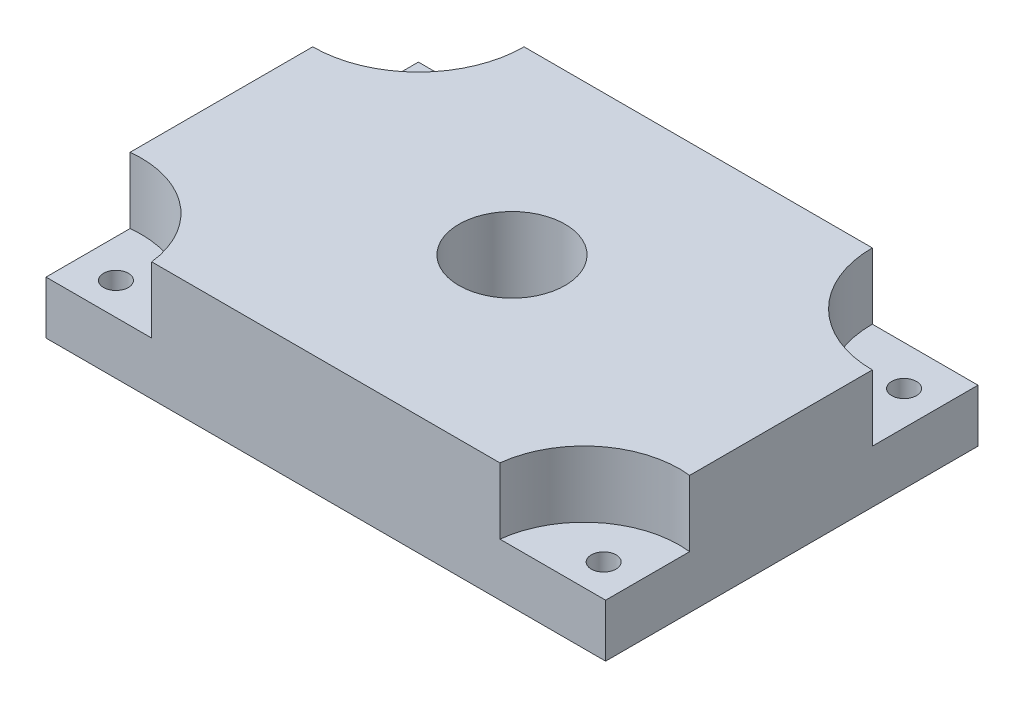
ISO-10303-21;
HEADER;
FILE_DESCRIPTION(('STEP AP214'),'2;1');
FILE_NAME('part.step','',(''),(''),'','','');
FILE_SCHEMA(('AUTOMOTIVE_DESIGN { 1 0 10303 214 1 1 1 1 }'));
ENDSEC;
DATA;
#1=APPLICATION_CONTEXT('core data for automotive mechanical design processes');
#2=APPLICATION_PROTOCOL_DEFINITION('international standard','automotive_design',2000,#1);
#3=PRODUCT_CONTEXT('',#1,'mechanical');
#4=PRODUCT('Part','Part','',(#3));
#5=PRODUCT_RELATED_PRODUCT_CATEGORY('part','',(#4));
#6=PRODUCT_DEFINITION_FORMATION('','',#4);
#7=PRODUCT_DEFINITION_CONTEXT('part definition',#1,'design');
#8=PRODUCT_DEFINITION('design','',#6,#7);
#9=PRODUCT_DEFINITION_SHAPE('','',#8);
#10=(LENGTH_UNIT() NAMED_UNIT(*) SI_UNIT(.MILLI.,.METRE.));
#11=(NAMED_UNIT(*) PLANE_ANGLE_UNIT() SI_UNIT($,.RADIAN.));
#12=(NAMED_UNIT(*) SI_UNIT($,.STERADIAN.) SOLID_ANGLE_UNIT());
#13=UNCERTAINTY_MEASURE_WITH_UNIT(LENGTH_MEASURE(1.E-05),#10,'distance_accuracy_value','');
#14=(GEOMETRIC_REPRESENTATION_CONTEXT(3) GLOBAL_UNCERTAINTY_ASSIGNED_CONTEXT((#13)) GLOBAL_UNIT_ASSIGNED_CONTEXT((#10,
#11,#12)) REPRESENTATION_CONTEXT('',''));
#15=CARTESIAN_POINT('',(0.,0.,0.));
#16=DIRECTION('',(0.,0.,1.));
#17=DIRECTION('',(1.,0.,0.));
#18=AXIS2_PLACEMENT_3D('',#15,#16,#17);
#19=CARTESIAN_POINT('',(0.,2.54,0.));
#20=DIRECTION('',(0.,1.,0.));
#21=DIRECTION('',(0.,0.,1.));
#22=AXIS2_PLACEMENT_3D('',#19,#20,#21);
#23=PLANE('',#22);
#24=CARTESIAN_POINT('',(-11.6306743768178,2.54,7.40687426286435));
#25=DIRECTION('',(0.,1.,0.));
#26=DIRECTION('',(0.,0.,1.));
#27=AXIS2_PLACEMENT_3D('',#24,#25,#26);
#28=CIRCLE('',#27,0.595376);
#29=CARTESIAN_POINT('',(-11.6306743768178,2.54,8.00225026286435));
#30=VERTEX_POINT('',#29);
#31=EDGE_CURVE('E266',#30,#30,#28,.T.);
#32=ORIENTED_EDGE('',*,*,#31,.F.);
#33=EDGE_LOOP('',(#32));
#34=FACE_BOUND('',#33,.T.);
#35=CARTESIAN_POINT('',(-12.9296799296813,2.54,9.4703200703187));
#36=DIRECTION('',(0.,-1.,0.));
#37=DIRECTION('',(0.,0.,-1.));
#38=AXIS2_PLACEMENT_3D('',#35,#36,#37);
#39=CIRCLE('',#38,4.58927162376722);
#40=CARTESIAN_POINT('',(-13.45,2.54,4.91064014063738));
#41=VERTEX_POINT('',#40);
#42=CARTESIAN_POINT('',(-8.37000000000002,2.54,8.95));
#43=VERTEX_POINT('',#42);
#44=EDGE_CURVE('E146',#41,#43,#39,.T.);
#45=ORIENTED_EDGE('',*,*,#44,.F.);
#46=DIRECTION('',(0.,0.,1.));
#47=VECTOR('',#46,1.);
#48=CARTESIAN_POINT('',(-13.45,2.54,-8.95));
#49=LINE('',#48,#47);
#50=CARTESIAN_POINT('',(-13.45,2.54,8.95));
#51=VERTEX_POINT('',#50);
#52=EDGE_CURVE('E162',#41,#51,#49,.T.);
#53=ORIENTED_EDGE('',*,*,#52,.T.);
#54=DIRECTION('',(1.,0.,0.));
#55=VECTOR('',#54,1.);
#56=CARTESIAN_POINT('',(-13.45,2.54,8.95));
#57=LINE('',#56,#55);
#58=EDGE_CURVE('E58',#51,#43,#57,.T.);
#59=ORIENTED_EDGE('',*,*,#58,.T.);
#60=EDGE_LOOP('',(#45,#53,#59));
#61=FACE_BOUND('',#60,.T.);
#62=ADVANCED_FACE('F35',(#34,#61),#23,.T.);
#63=CARTESIAN_POINT('',(-11.6306743768178,2.54,-7.03306943770432));
#64=DIRECTION('',(0.,1.,0.));
#65=DIRECTION('',(0.,0.,1.));
#66=AXIS2_PLACEMENT_3D('',#63,#64,#65);
#67=CIRCLE('',#66,0.595376);
#68=CARTESIAN_POINT('',(-11.6306743768178,2.54,-6.43769343770432));
#69=VERTEX_POINT('',#68);
#70=EDGE_CURVE('E272',#69,#69,#67,.T.);
#71=ORIENTED_EDGE('',*,*,#70,.F.);
#72=EDGE_LOOP('',(#71));
#73=FACE_BOUND('',#72,.T.);
#74=CARTESIAN_POINT('',(-13.45,2.54,-8.94999999999999));
#75=DIRECTION('',(0.,-1.,0.));
#76=DIRECTION('',(0.,0.,1.));
#77=AXIS2_PLACEMENT_3D('',#74,#75,#76);
#78=CIRCLE('',#77,5.07999999999999);
#79=CARTESIAN_POINT('',(-8.37000000000002,2.54,-8.95));
#80=VERTEX_POINT('',#79);
#81=CARTESIAN_POINT('',(-13.45,2.54,-3.87));
#82=VERTEX_POINT('',#81);
#83=EDGE_CURVE('E143',#80,#82,#78,.T.);
#84=ORIENTED_EDGE('',*,*,#83,.F.);
#85=DIRECTION('',(-1.,0.,0.));
#86=VECTOR('',#85,1.);
#87=CARTESIAN_POINT('',(-13.45,2.54,-8.95));
#88=LINE('',#87,#86);
#89=CARTESIAN_POINT('',(-13.45,2.54,-8.95));
#90=VERTEX_POINT('',#89);
#91=EDGE_CURVE('E158',#80,#90,#88,.T.);
#92=ORIENTED_EDGE('',*,*,#91,.T.);
#93=EDGE_CURVE('E163',#90,#82,#49,.T.);
#94=ORIENTED_EDGE('',*,*,#93,.T.);
#95=EDGE_LOOP('',(#84,#92,#94));
#96=FACE_BOUND('',#95,.T.);
#97=ADVANCED_FACE('F278',(#73,#96),#23,.T.);
#98=CARTESIAN_POINT('',(11.8134024359264,2.54,-7.03306943770432));
#99=DIRECTION('',(0.,1.,0.));
#100=DIRECTION('',(0.,0.,1.));
#101=AXIS2_PLACEMENT_3D('',#98,#99,#100);
#102=CIRCLE('',#101,0.595376);
#103=CARTESIAN_POINT('',(11.8134024359264,2.54,-6.43769343770432));
#104=VERTEX_POINT('',#103);
#105=EDGE_CURVE('E254',#104,#104,#102,.T.);
#106=ORIENTED_EDGE('',*,*,#105,.F.);
#107=EDGE_LOOP('',(#106));
#108=FACE_BOUND('',#107,.T.);
#109=CARTESIAN_POINT('',(13.45,2.54,-8.95));
#110=DIRECTION('',(0.,-1.,0.));
#111=DIRECTION('',(0.,0.,1.));
#112=AXIS2_PLACEMENT_3D('',#109,#110,#111);
#113=CIRCLE('',#112,5.08000000000001);
#114=CARTESIAN_POINT('',(13.45,2.54,-3.87));
#115=VERTEX_POINT('',#114);
#116=CARTESIAN_POINT('',(8.37000000000002,2.54,-8.95));
#117=VERTEX_POINT('',#116);
#118=EDGE_CURVE('E201',#115,#117,#113,.T.);
#119=ORIENTED_EDGE('',*,*,#118,.F.);
#120=DIRECTION('',(0.,0.,-1.));
#121=VECTOR('',#120,1.);
#122=CARTESIAN_POINT('',(13.45,2.54,-8.95));
#123=LINE('',#122,#121);
#124=CARTESIAN_POINT('',(13.45,2.54,-8.95));
#125=VERTEX_POINT('',#124);
#126=EDGE_CURVE('E159',#115,#125,#123,.T.);
#127=ORIENTED_EDGE('',*,*,#126,.T.);
#128=EDGE_CURVE('E160',#125,#117,#88,.T.);
#129=ORIENTED_EDGE('',*,*,#128,.T.);
#130=EDGE_LOOP('',(#119,#127,#129));
#131=FACE_BOUND('',#130,.T.);
#132=ADVANCED_FACE('F233',(#108,#131),#23,.T.);
#133=CARTESIAN_POINT('',(11.8134024359264,2.54,7.40687426286435));
#134=DIRECTION('',(0.,1.,0.));
#135=DIRECTION('',(0.,0.,1.));
#136=AXIS2_PLACEMENT_3D('',#133,#134,#135);
#137=CIRCLE('',#136,0.595376);
#138=CARTESIAN_POINT('',(11.8134024359264,2.54,8.00225026286435));
#139=VERTEX_POINT('',#138);
#140=EDGE_CURVE('E260',#139,#139,#137,.T.);
#141=ORIENTED_EDGE('',*,*,#140,.F.);
#142=EDGE_LOOP('',(#141));
#143=FACE_BOUND('',#142,.T.);
#144=CARTESIAN_POINT('',(12.9296799296814,2.54,9.47032007031873));
#145=DIRECTION('',(0.,-1.,0.));
#146=DIRECTION('',(0.,0.,1.));
#147=AXIS2_PLACEMENT_3D('',#144,#145,#146);
#148=CIRCLE('',#147,4.58927162376725);
#149=CARTESIAN_POINT('',(8.37000000000002,2.54,8.95));
#150=VERTEX_POINT('',#149);
#151=CARTESIAN_POINT('',(13.45,2.54,4.91064014063739));
#152=VERTEX_POINT('',#151);
#153=EDGE_CURVE('E50',#150,#152,#148,.T.);
#154=ORIENTED_EDGE('',*,*,#153,.F.);
#155=CARTESIAN_POINT('',(13.45,2.54,8.95));
#156=VERTEX_POINT('',#155);
#157=EDGE_CURVE('E165',#150,#156,#57,.T.);
#158=ORIENTED_EDGE('',*,*,#157,.T.);
#159=EDGE_CURVE('E156',#156,#152,#123,.T.);
#160=ORIENTED_EDGE('',*,*,#159,.T.);
#161=EDGE_LOOP('',(#154,#158,#160));
#162=FACE_BOUND('',#161,.T.);
#163=ADVANCED_FACE('F198',(#143,#162),#23,.T.);
#164=CARTESIAN_POINT('',(13.45,2.54,-8.95));
#165=DIRECTION('',(-1.,0.,0.));
#166=DIRECTION('',(0.,0.,1.));
#167=AXIS2_PLACEMENT_3D('',#164,#165,#166);
#168=PLANE('',#167);
#169=DIRECTION('',(0.,0.,-1.));
#170=VECTOR('',#169,1.);
#171=CARTESIAN_POINT('',(13.45,0.,-8.95));
#172=LINE('',#171,#170);
#173=CARTESIAN_POINT('',(13.45,0.,8.95));
#174=VERTEX_POINT('',#173);
#175=CARTESIAN_POINT('',(13.45,0.,-8.95));
#176=VERTEX_POINT('',#175);
#177=EDGE_CURVE('E147',#174,#176,#172,.T.);
#178=ORIENTED_EDGE('',*,*,#177,.T.);
#179=DIRECTION('',(0.,-1.,0.));
#180=VECTOR('',#179,1.);
#181=CARTESIAN_POINT('',(13.45,2.54,-8.95));
#182=LINE('',#181,#180);
#183=EDGE_CURVE('E11',#125,#176,#182,.T.);
#184=ORIENTED_EDGE('',*,*,#183,.F.);
#185=ORIENTED_EDGE('',*,*,#126,.F.);
#186=DIRECTION('',(0.,-1.,0.));
#187=VECTOR('',#186,1.);
#188=CARTESIAN_POINT('',(13.45,5.715,-3.87));
#189=LINE('',#188,#187);
#190=CARTESIAN_POINT('',(13.45,5.715,-3.87));
#191=VERTEX_POINT('',#190);
#192=EDGE_CURVE('E221',#191,#115,#189,.T.);
#193=ORIENTED_EDGE('',*,*,#192,.F.);
#194=DIRECTION('',(0.,0.,-1.));
#195=VECTOR('',#194,1.);
#196=CARTESIAN_POINT('',(13.45,5.715,-3.87));
#197=LINE('',#196,#195);
#198=CARTESIAN_POINT('',(13.45,5.715,4.91064014063739));
#199=VERTEX_POINT('',#198);
#200=EDGE_CURVE('E230',#199,#191,#197,.T.);
#201=ORIENTED_EDGE('',*,*,#200,.F.);
#202=DIRECTION('',(0.,-1.,0.));
#203=VECTOR('',#202,1.);
#204=CARTESIAN_POINT('',(13.45,5.715,4.91064014063739));
#205=LINE('',#204,#203);
#206=EDGE_CURVE('E152',#199,#152,#205,.T.);
#207=ORIENTED_EDGE('',*,*,#206,.T.);
#208=ORIENTED_EDGE('',*,*,#159,.F.);
#209=DIRECTION('',(0.,-1.,0.));
#210=VECTOR('',#209,1.);
#211=CARTESIAN_POINT('',(13.45,2.54,8.95));
#212=LINE('',#211,#210);
#213=EDGE_CURVE('E166',#156,#174,#212,.T.);
#214=ORIENTED_EDGE('',*,*,#213,.T.);
#215=EDGE_LOOP('',(#178,#184,#185,#193,#201,#207,#208,#214));
#216=FACE_BOUND('',#215,.T.);
#217=ADVANCED_FACE('F37',(#216),#168,.F.);
#218=CARTESIAN_POINT('',(-13.45,2.54,-8.95));
#219=DIRECTION('',(0.,0.,1.));
#220=DIRECTION('',(1.,0.,0.));
#221=AXIS2_PLACEMENT_3D('',#218,#219,#220);
#222=PLANE('',#221);
#223=DIRECTION('',(-1.,0.,0.));
#224=VECTOR('',#223,1.);
#225=CARTESIAN_POINT('',(-13.45,0.,-8.95));
#226=LINE('',#225,#224);
#227=CARTESIAN_POINT('',(-13.45,0.,-8.95));
#228=VERTEX_POINT('',#227);
#229=EDGE_CURVE('E150',#176,#228,#226,.T.);
#230=ORIENTED_EDGE('',*,*,#229,.T.);
#231=DIRECTION('',(0.,-1.,0.));
#232=VECTOR('',#231,1.);
#233=CARTESIAN_POINT('',(-13.45,2.54,-8.95));
#234=LINE('',#233,#232);
#235=EDGE_CURVE('E43',#90,#228,#234,.T.);
#236=ORIENTED_EDGE('',*,*,#235,.F.);
#237=ORIENTED_EDGE('',*,*,#91,.F.);
#238=DIRECTION('',(0.,-1.,0.));
#239=VECTOR('',#238,1.);
#240=CARTESIAN_POINT('',(-8.37000000000002,5.715,-8.95));
#241=LINE('',#240,#239);
#242=CARTESIAN_POINT('',(-8.37000000000002,5.715,-8.95));
#243=VERTEX_POINT('',#242);
#244=EDGE_CURVE('E215',#243,#80,#241,.T.);
#245=ORIENTED_EDGE('',*,*,#244,.F.);
#246=DIRECTION('',(-1.,0.,0.));
#247=VECTOR('',#246,1.);
#248=CARTESIAN_POINT('',(-8.37000000000002,5.715,-8.95));
#249=LINE('',#248,#247);
#250=CARTESIAN_POINT('',(8.37000000000002,5.715,-8.95));
#251=VERTEX_POINT('',#250);
#252=EDGE_CURVE('E237',#251,#243,#249,.T.);
#253=ORIENTED_EDGE('',*,*,#252,.F.);
#254=DIRECTION('',(0.,-1.,0.));
#255=VECTOR('',#254,1.);
#256=CARTESIAN_POINT('',(8.37000000000002,5.715,-8.95));
#257=LINE('',#256,#255);
#258=EDGE_CURVE('E218',#251,#117,#257,.T.);
#259=ORIENTED_EDGE('',*,*,#258,.T.);
#260=ORIENTED_EDGE('',*,*,#128,.F.);
#261=ORIENTED_EDGE('',*,*,#183,.T.);
#262=EDGE_LOOP('',(#230,#236,#237,#245,#253,#259,#260,#261));
#263=FACE_BOUND('',#262,.T.);
#264=ADVANCED_FACE('F234',(#263),#222,.F.);
#265=CARTESIAN_POINT('',(-13.45,2.54,-8.95));
#266=DIRECTION('',(1.,0.,0.));
#267=DIRECTION('',(0.,0.,-1.));
#268=AXIS2_PLACEMENT_3D('',#265,#266,#267);
#269=PLANE('',#268);
#270=DIRECTION('',(0.,0.,1.));
#271=VECTOR('',#270,1.);
#272=CARTESIAN_POINT('',(-13.45,0.,-8.95));
#273=LINE('',#272,#271);
#274=CARTESIAN_POINT('',(-13.45,0.,8.95));
#275=VERTEX_POINT('',#274);
#276=EDGE_CURVE('E169',#228,#275,#273,.T.);
#277=ORIENTED_EDGE('',*,*,#276,.T.);
#278=DIRECTION('',(0.,-1.,0.));
#279=VECTOR('',#278,1.);
#280=CARTESIAN_POINT('',(-13.45,2.54,8.95));
#281=LINE('',#280,#279);
#282=EDGE_CURVE('E175',#51,#275,#281,.T.);
#283=ORIENTED_EDGE('',*,*,#282,.F.);
#284=ORIENTED_EDGE('',*,*,#52,.F.);
#285=DIRECTION('',(0.,-1.,0.));
#286=VECTOR('',#285,1.);
#287=CARTESIAN_POINT('',(-13.45,5.715,4.91064014063738));
#288=LINE('',#287,#286);
#289=CARTESIAN_POINT('',(-13.45,5.715,4.91064014063738));
#290=VERTEX_POINT('',#289);
#291=EDGE_CURVE('E211',#290,#41,#288,.T.);
#292=ORIENTED_EDGE('',*,*,#291,.F.);
#293=DIRECTION('',(0.,0.,1.));
#294=VECTOR('',#293,1.);
#295=CARTESIAN_POINT('',(-13.45,5.715,-3.87));
#296=LINE('',#295,#294);
#297=CARTESIAN_POINT('',(-13.45,5.715,-3.87));
#298=VERTEX_POINT('',#297);
#299=EDGE_CURVE('E139',#298,#290,#296,.T.);
#300=ORIENTED_EDGE('',*,*,#299,.F.);
#301=DIRECTION('',(0.,-1.,0.));
#302=VECTOR('',#301,1.);
#303=CARTESIAN_POINT('',(-13.45,5.715,-3.87));
#304=LINE('',#303,#302);
#305=EDGE_CURVE('E213',#298,#82,#304,.T.);
#306=ORIENTED_EDGE('',*,*,#305,.T.);
#307=ORIENTED_EDGE('',*,*,#93,.F.);
#308=ORIENTED_EDGE('',*,*,#235,.T.);
#309=EDGE_LOOP('',(#277,#283,#284,#292,#300,#306,#307,#308));
#310=FACE_BOUND('',#309,.T.);
#311=ADVANCED_FACE('F182',(#310),#269,.F.);
#312=CARTESIAN_POINT('',(-13.45,2.54,8.95));
#313=DIRECTION('',(0.,0.,-1.));
#314=DIRECTION('',(-1.,0.,0.));
#315=AXIS2_PLACEMENT_3D('',#312,#313,#314);
#316=PLANE('',#315);
#317=DIRECTION('',(1.,0.,0.));
#318=VECTOR('',#317,1.);
#319=CARTESIAN_POINT('',(-13.45,0.,8.95));
#320=LINE('',#319,#318);
#321=EDGE_CURVE('E171',#275,#174,#320,.T.);
#322=ORIENTED_EDGE('',*,*,#321,.T.);
#323=ORIENTED_EDGE('',*,*,#213,.F.);
#324=ORIENTED_EDGE('',*,*,#157,.F.);
#325=DIRECTION('',(0.,-1.,0.));
#326=VECTOR('',#325,1.);
#327=CARTESIAN_POINT('',(8.37000000000002,5.715,8.95));
#328=LINE('',#327,#326);
#329=CARTESIAN_POINT('',(8.37000000000002,5.715,8.95));
#330=VERTEX_POINT('',#329);
#331=EDGE_CURVE('E130',#330,#150,#328,.T.);
#332=ORIENTED_EDGE('',*,*,#331,.F.);
#333=DIRECTION('',(1.,0.,0.));
#334=VECTOR('',#333,1.);
#335=CARTESIAN_POINT('',(-8.37000000000002,5.715,8.95));
#336=LINE('',#335,#334);
#337=CARTESIAN_POINT('',(-8.37000000000002,5.715,8.95));
#338=VERTEX_POINT('',#337);
#339=EDGE_CURVE('E123',#338,#330,#336,.T.);
#340=ORIENTED_EDGE('',*,*,#339,.F.);
#341=DIRECTION('',(0.,-1.,0.));
#342=VECTOR('',#341,1.);
#343=CARTESIAN_POINT('',(-8.37000000000002,5.715,8.95));
#344=LINE('',#343,#342);
#345=EDGE_CURVE('E127',#338,#43,#344,.T.);
#346=ORIENTED_EDGE('',*,*,#345,.T.);
#347=ORIENTED_EDGE('',*,*,#58,.F.);
#348=ORIENTED_EDGE('',*,*,#282,.T.);
#349=EDGE_LOOP('',(#322,#323,#324,#332,#340,#346,#347,#348));
#350=FACE_BOUND('',#349,.T.);
#351=ADVANCED_FACE('F125',(#350),#316,.F.);
#352=CARTESIAN_POINT('',(0.,0.,0.));
#353=DIRECTION('',(0.,1.,0.));
#354=DIRECTION('',(0.,0.,1.));
#355=AXIS2_PLACEMENT_3D('',#352,#353,#354);
#356=PLANE('',#355);
#357=CARTESIAN_POINT('',(-11.6306743768178,0.,-7.03306943770432));
#358=DIRECTION('',(0.,1.,0.));
#359=DIRECTION('',(0.,0.,1.));
#360=AXIS2_PLACEMENT_3D('',#357,#358,#359);
#361=CIRCLE('',#360,0.595376);
#362=CARTESIAN_POINT('',(-11.6306743768178,0.,-6.43769343770432));
#363=VERTEX_POINT('',#362);
#364=EDGE_CURVE('E269',#363,#363,#361,.T.);
#365=ORIENTED_EDGE('',*,*,#364,.T.);
#366=EDGE_LOOP('',(#365));
#367=FACE_BOUND('',#366,.T.);
#368=CARTESIAN_POINT('',(-11.6306743768178,0.,7.40687426286435));
#369=DIRECTION('',(0.,1.,0.));
#370=DIRECTION('',(0.,0.,1.));
#371=AXIS2_PLACEMENT_3D('',#368,#369,#370);
#372=CIRCLE('',#371,0.595376);
#373=CARTESIAN_POINT('',(-11.6306743768178,0.,8.00225026286435));
#374=VERTEX_POINT('',#373);
#375=EDGE_CURVE('E263',#374,#374,#372,.T.);
#376=ORIENTED_EDGE('',*,*,#375,.T.);
#377=EDGE_LOOP('',(#376));
#378=FACE_BOUND('',#377,.T.);
#379=CARTESIAN_POINT('',(11.8134024359264,0.,7.40687426286435));
#380=DIRECTION('',(0.,1.,0.));
#381=DIRECTION('',(0.,0.,1.));
#382=AXIS2_PLACEMENT_3D('',#379,#380,#381);
#383=CIRCLE('',#382,0.595376);
#384=CARTESIAN_POINT('',(11.8134024359264,0.,8.00225026286435));
#385=VERTEX_POINT('',#384);
#386=EDGE_CURVE('E257',#385,#385,#383,.T.);
#387=ORIENTED_EDGE('',*,*,#386,.T.);
#388=EDGE_LOOP('',(#387));
#389=FACE_BOUND('',#388,.T.);
#390=CARTESIAN_POINT('',(11.8134024359264,0.,-7.03306943770432));
#391=DIRECTION('',(0.,1.,0.));
#392=DIRECTION('',(0.,0.,1.));
#393=AXIS2_PLACEMENT_3D('',#390,#391,#392);
#394=CIRCLE('',#393,0.595376);
#395=CARTESIAN_POINT('',(11.8134024359264,0.,-6.43769343770432));
#396=VERTEX_POINT('',#395);
#397=EDGE_CURVE('E251',#396,#396,#394,.T.);
#398=ORIENTED_EDGE('',*,*,#397,.T.);
#399=EDGE_LOOP('',(#398));
#400=FACE_BOUND('',#399,.T.);
#401=CARTESIAN_POINT('',(0.,0.,0.));
#402=DIRECTION('',(0.,1.,0.));
#403=DIRECTION('',(0.,0.,1.));
#404=AXIS2_PLACEMENT_3D('',#401,#402,#403);
#405=CIRCLE('',#404,2.5527);
#406=CARTESIAN_POINT('',(0.,0.,2.5527));
#407=VERTEX_POINT('',#406);
#408=EDGE_CURVE('E205',#407,#407,#405,.T.);
#409=ORIENTED_EDGE('',*,*,#408,.T.);
#410=EDGE_LOOP('',(#409));
#411=FACE_BOUND('',#410,.T.);
#412=ORIENTED_EDGE('',*,*,#177,.F.);
#413=ORIENTED_EDGE('',*,*,#321,.F.);
#414=ORIENTED_EDGE('',*,*,#276,.F.);
#415=ORIENTED_EDGE('',*,*,#229,.F.);
#416=EDGE_LOOP('',(#412,#413,#414,#415));
#417=FACE_BOUND('',#416,.T.);
#418=ADVANCED_FACE('F190',(#367,#378,#389,#400,#411,#417),#356,.F.);
#419=CARTESIAN_POINT('',(-12.9296799296813,5.715,9.4703200703187));
#420=DIRECTION('',(0.,-1.,0.));
#421=DIRECTION('',(0.,0.,-1.));
#422=AXIS2_PLACEMENT_3D('',#419,#420,#421);
#423=CYLINDRICAL_SURFACE('',#422,4.58927162376722);
#424=ORIENTED_EDGE('',*,*,#44,.T.);
#425=ORIENTED_EDGE('',*,*,#345,.F.);
#426=CARTESIAN_POINT('',(-12.9296799296813,5.715,9.4703200703187));
#427=DIRECTION('',(0.,-1.,0.));
#428=DIRECTION('',(0.,0.,-1.));
#429=AXIS2_PLACEMENT_3D('',#426,#427,#428);
#430=CIRCLE('',#429,4.58927162376722);
#431=EDGE_CURVE('E134',#290,#338,#430,.T.);
#432=ORIENTED_EDGE('',*,*,#431,.F.);
#433=ORIENTED_EDGE('',*,*,#291,.T.);
#434=EDGE_LOOP('',(#424,#425,#432,#433));
#435=FACE_BOUND('',#434,.T.);
#436=ADVANCED_FACE('F145',(#435),#423,.F.);
#437=CARTESIAN_POINT('',(12.9296799296814,5.715,9.47032007031873));
#438=DIRECTION('',(0.,-1.,0.));
#439=DIRECTION('',(0.,0.,-1.));
#440=AXIS2_PLACEMENT_3D('',#437,#438,#439);
#441=CYLINDRICAL_SURFACE('',#440,4.58927162376725);
#442=ORIENTED_EDGE('',*,*,#153,.T.);
#443=ORIENTED_EDGE('',*,*,#206,.F.);
#444=CARTESIAN_POINT('',(12.9296799296814,5.715,9.47032007031873));
#445=DIRECTION('',(0.,-1.,0.));
#446=DIRECTION('',(0.,0.,1.));
#447=AXIS2_PLACEMENT_3D('',#444,#445,#446);
#448=CIRCLE('',#447,4.58927162376725);
#449=EDGE_CURVE('E133',#330,#199,#448,.T.);
#450=ORIENTED_EDGE('',*,*,#449,.F.);
#451=ORIENTED_EDGE('',*,*,#331,.T.);
#452=EDGE_LOOP('',(#442,#443,#450,#451));
#453=FACE_BOUND('',#452,.T.);
#454=ADVANCED_FACE('F200',(#453),#441,.F.);
#455=CARTESIAN_POINT('',(13.45,5.715,-8.95));
#456=DIRECTION('',(0.,-1.,0.));
#457=DIRECTION('',(0.,0.,-1.));
#458=AXIS2_PLACEMENT_3D('',#455,#456,#457);
#459=CYLINDRICAL_SURFACE('',#458,5.08000000000001);
#460=ORIENTED_EDGE('',*,*,#118,.T.);
#461=ORIENTED_EDGE('',*,*,#258,.F.);
#462=CARTESIAN_POINT('',(13.45,5.715,-8.95));
#463=DIRECTION('',(0.,-1.,0.));
#464=DIRECTION('',(0.,0.,1.));
#465=AXIS2_PLACEMENT_3D('',#462,#463,#464);
#466=CIRCLE('',#465,5.08000000000001);
#467=EDGE_CURVE('E228',#191,#251,#466,.T.);
#468=ORIENTED_EDGE('',*,*,#467,.F.);
#469=ORIENTED_EDGE('',*,*,#192,.T.);
#470=EDGE_LOOP('',(#460,#461,#468,#469));
#471=FACE_BOUND('',#470,.T.);
#472=ADVANCED_FACE('F226',(#471),#459,.F.);
#473=CARTESIAN_POINT('',(-13.45,5.715,-8.94999999999999));
#474=DIRECTION('',(0.,-1.,0.));
#475=DIRECTION('',(0.,0.,-1.));
#476=AXIS2_PLACEMENT_3D('',#473,#474,#475);
#477=CYLINDRICAL_SURFACE('',#476,5.07999999999999);
#478=ORIENTED_EDGE('',*,*,#83,.T.);
#479=ORIENTED_EDGE('',*,*,#305,.F.);
#480=CARTESIAN_POINT('',(-13.45,5.715,-8.94999999999999));
#481=DIRECTION('',(0.,-1.,0.));
#482=DIRECTION('',(0.,0.,1.));
#483=AXIS2_PLACEMENT_3D('',#480,#481,#482);
#484=CIRCLE('',#483,5.07999999999999);
#485=EDGE_CURVE('E239',#243,#298,#484,.T.);
#486=ORIENTED_EDGE('',*,*,#485,.F.);
#487=ORIENTED_EDGE('',*,*,#244,.T.);
#488=EDGE_LOOP('',(#478,#479,#486,#487));
#489=FACE_BOUND('',#488,.T.);
#490=ADVANCED_FACE('F284',(#489),#477,.F.);
#491=CARTESIAN_POINT('',(-12.9296799296813,5.715,9.4703200703187));
#492=DIRECTION('',(0.,-1.,0.));
#493=DIRECTION('',(0.,0.,-1.));
#494=AXIS2_PLACEMENT_3D('',#491,#492,#493);
#495=PLANE('',#494);
#496=CARTESIAN_POINT('',(0.,5.715,0.));
#497=DIRECTION('',(0.,1.,0.));
#498=DIRECTION('',(0.,0.,1.));
#499=AXIS2_PLACEMENT_3D('',#496,#497,#498);
#500=CIRCLE('',#499,2.5527);
#501=CARTESIAN_POINT('',(0.,5.715,2.5527));
#502=VERTEX_POINT('',#501);
#503=EDGE_CURVE('E248',#502,#502,#500,.T.);
#504=ORIENTED_EDGE('',*,*,#503,.F.);
#505=EDGE_LOOP('',(#504));
#506=FACE_BOUND('',#505,.T.);
#507=ORIENTED_EDGE('',*,*,#431,.T.);
#508=ORIENTED_EDGE('',*,*,#339,.T.);
#509=ORIENTED_EDGE('',*,*,#449,.T.);
#510=ORIENTED_EDGE('',*,*,#200,.T.);
#511=ORIENTED_EDGE('',*,*,#467,.T.);
#512=ORIENTED_EDGE('',*,*,#252,.T.);
#513=ORIENTED_EDGE('',*,*,#485,.T.);
#514=ORIENTED_EDGE('',*,*,#299,.T.);
#515=EDGE_LOOP('',(#507,#508,#509,#510,#511,#512,#513,#514));
#516=FACE_BOUND('',#515,.T.);
#517=ADVANCED_FACE('F137',(#506,#516),#495,.F.);
#518=CARTESIAN_POINT('',(0.,5.715,0.));
#519=DIRECTION('',(0.,1.,0.));
#520=DIRECTION('',(0.,0.,1.));
#521=AXIS2_PLACEMENT_3D('',#518,#519,#520);
#522=CYLINDRICAL_SURFACE('',#521,2.5527);
#523=ORIENTED_EDGE('',*,*,#408,.F.);
#524=EDGE_LOOP('',(#523));
#525=FACE_BOUND('',#524,.T.);
#526=ORIENTED_EDGE('',*,*,#503,.T.);
#527=EDGE_LOOP('',(#526));
#528=FACE_BOUND('',#527,.T.);
#529=ADVANCED_FACE('F314',(#525,#528),#522,.F.);
#530=CARTESIAN_POINT('',(11.8134024359264,2.54,-7.03306943770432));
#531=DIRECTION('',(0.,1.,0.));
#532=DIRECTION('',(0.,0.,1.));
#533=AXIS2_PLACEMENT_3D('',#530,#531,#532);
#534=CYLINDRICAL_SURFACE('',#533,0.595376);
#535=ORIENTED_EDGE('',*,*,#397,.F.);
#536=EDGE_LOOP('',(#535));
#537=FACE_BOUND('',#536,.T.);
#538=ORIENTED_EDGE('',*,*,#105,.T.);
#539=EDGE_LOOP('',(#538));
#540=FACE_BOUND('',#539,.T.);
#541=ADVANCED_FACE('F305',(#537,#540),#534,.F.);
#542=CARTESIAN_POINT('',(11.8134024359264,2.54,7.40687426286435));
#543=DIRECTION('',(0.,1.,0.));
#544=DIRECTION('',(0.,0.,1.));
#545=AXIS2_PLACEMENT_3D('',#542,#543,#544);
#546=CYLINDRICAL_SURFACE('',#545,0.595376);
#547=ORIENTED_EDGE('',*,*,#386,.F.);
#548=EDGE_LOOP('',(#547));
#549=FACE_BOUND('',#548,.T.);
#550=ORIENTED_EDGE('',*,*,#140,.T.);
#551=EDGE_LOOP('',(#550));
#552=FACE_BOUND('',#551,.T.);
#553=ADVANCED_FACE('F302',(#549,#552),#546,.F.);
#554=CARTESIAN_POINT('',(-11.6306743768178,2.54,7.40687426286435));
#555=DIRECTION('',(0.,1.,0.));
#556=DIRECTION('',(0.,0.,1.));
#557=AXIS2_PLACEMENT_3D('',#554,#555,#556);
#558=CYLINDRICAL_SURFACE('',#557,0.595376);
#559=ORIENTED_EDGE('',*,*,#375,.F.);
#560=EDGE_LOOP('',(#559));
#561=FACE_BOUND('',#560,.T.);
#562=ORIENTED_EDGE('',*,*,#31,.T.);
#563=EDGE_LOOP('',(#562));
#564=FACE_BOUND('',#563,.T.);
#565=ADVANCED_FACE('F304',(#561,#564),#558,.F.);
#566=CARTESIAN_POINT('',(-11.6306743768178,2.54,-7.03306943770432));
#567=DIRECTION('',(0.,1.,0.));
#568=DIRECTION('',(0.,0.,1.));
#569=AXIS2_PLACEMENT_3D('',#566,#567,#568);
#570=CYLINDRICAL_SURFACE('',#569,0.595376);
#571=ORIENTED_EDGE('',*,*,#364,.F.);
#572=EDGE_LOOP('',(#571));
#573=FACE_BOUND('',#572,.T.);
#574=ORIENTED_EDGE('',*,*,#70,.T.);
#575=EDGE_LOOP('',(#574));
#576=FACE_BOUND('',#575,.T.);
#577=ADVANCED_FACE('F276',(#573,#576),#570,.F.);
#578=CLOSED_SHELL('',(#62,#97,#132,#163,#217,#264,#311,#351,#418,#436,#454,#472,#490,#517,#529,
#541,#553,#565,#577));
#579=MANIFOLD_SOLID_BREP('B2',#578);
#580=ADVANCED_BREP_SHAPE_REPRESENTATION('',(#18,#579),#14);
#581=SHAPE_DEFINITION_REPRESENTATION(#9,#580);
ENDSEC;
END-ISO-10303-21;
